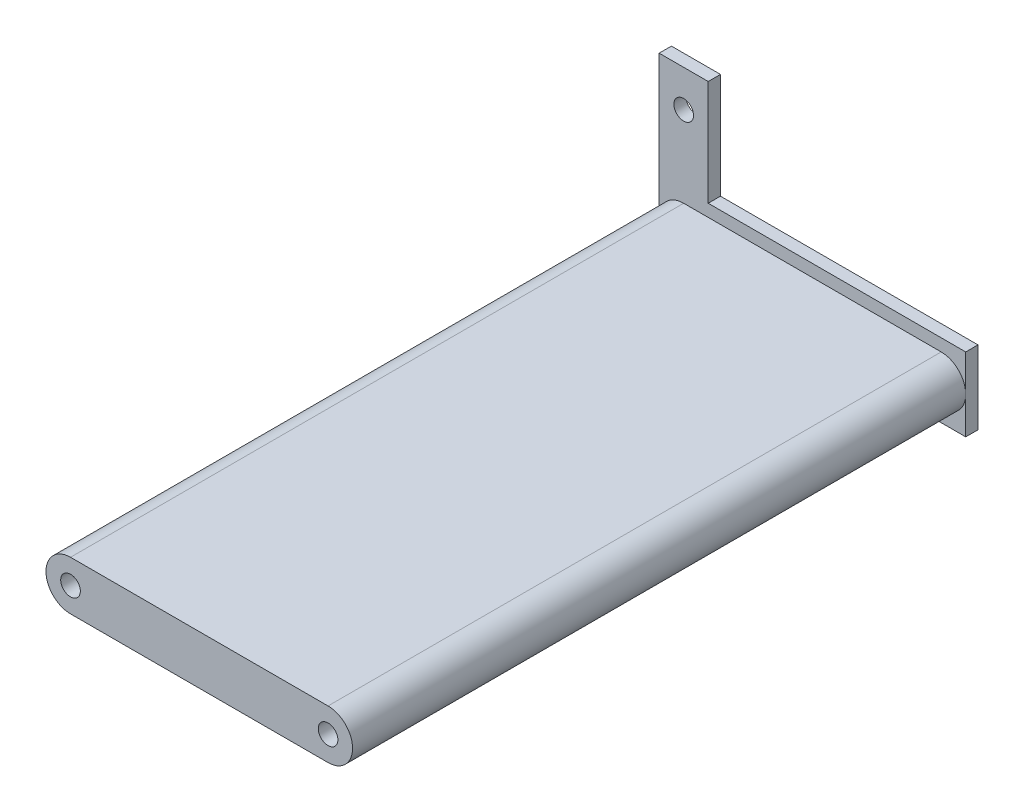
ISO-10303-21;
HEADER;
FILE_DESCRIPTION(('STEP AP214'),'2;1');
FILE_NAME('part.step','',(''),(''),'','','');
FILE_SCHEMA(('AUTOMOTIVE_DESIGN { 1 0 10303 214 1 1 1 1 }'));
ENDSEC;
DATA;
#1=APPLICATION_CONTEXT('core data for automotive mechanical design processes');
#2=APPLICATION_PROTOCOL_DEFINITION('international standard','automotive_design',2000,#1);
#3=PRODUCT_CONTEXT('',#1,'mechanical');
#4=PRODUCT('Part','Part','',(#3));
#5=PRODUCT_RELATED_PRODUCT_CATEGORY('part','',(#4));
#6=PRODUCT_DEFINITION_FORMATION('','',#4);
#7=PRODUCT_DEFINITION_CONTEXT('part definition',#1,'design');
#8=PRODUCT_DEFINITION('design','',#6,#7);
#9=PRODUCT_DEFINITION_SHAPE('','',#8);
#10=(LENGTH_UNIT() NAMED_UNIT(*) SI_UNIT(.MILLI.,.METRE.));
#11=(NAMED_UNIT(*) PLANE_ANGLE_UNIT() SI_UNIT($,.RADIAN.));
#12=(NAMED_UNIT(*) SI_UNIT($,.STERADIAN.) SOLID_ANGLE_UNIT());
#13=UNCERTAINTY_MEASURE_WITH_UNIT(LENGTH_MEASURE(1.E-05),#10,'distance_accuracy_value','');
#14=(GEOMETRIC_REPRESENTATION_CONTEXT(3) GLOBAL_UNCERTAINTY_ASSIGNED_CONTEXT((#13)) GLOBAL_UNIT_ASSIGNED_CONTEXT((#10,
#11,#12)) REPRESENTATION_CONTEXT('',''));
#15=CARTESIAN_POINT('',(0.,0.,0.));
#16=DIRECTION('',(0.,0.,1.));
#17=DIRECTION('',(1.,0.,0.));
#18=AXIS2_PLACEMENT_3D('',#15,#16,#17);
#19=CARTESIAN_POINT('',(0.,0.,1.27));
#20=DIRECTION('',(0.,0.,1.));
#21=DIRECTION('',(1.,0.,0.));
#22=AXIS2_PLACEMENT_3D('',#19,#20,#21);
#23=PLANE('',#22);
#24=DIRECTION('',(-1.,0.,0.));
#25=VECTOR('',#24,1.);
#26=CARTESIAN_POINT('',(-34.3291166187459,5.6003339009967,1.27));
#27=LINE('',#26,#25);
#28=CARTESIAN_POINT('',(-7.65911661874594,5.6003339009967,1.27));
#29=VERTEX_POINT('',#28);
#30=CARTESIAN_POINT('',(-34.3291166187459,5.6003339009967,1.27));
#31=VERTEX_POINT('',#30);
#32=EDGE_CURVE('E51',#29,#31,#27,.T.);
#33=ORIENTED_EDGE('',*,*,#32,.F.);
#34=CARTESIAN_POINT('',(-7.65911661874594,3.0603339009967,1.27));
#35=DIRECTION('',(0.,0.,1.));
#36=DIRECTION('',(1.,0.,0.));
#37=AXIS2_PLACEMENT_3D('',#34,#35,#36);
#38=CIRCLE('',#37,2.54);
#39=CARTESIAN_POINT('',(-5.11911661874593,3.0603339009967,1.27));
#40=VERTEX_POINT('',#39);
#41=EDGE_CURVE('E11',#40,#29,#38,.T.);
#42=ORIENTED_EDGE('',*,*,#41,.F.);
#43=DIRECTION('',(0.,1.,0.));
#44=VECTOR('',#43,1.);
#45=CARTESIAN_POINT('',(-5.11911661874593,-0.749666099003301,1.27));
#46=LINE('',#45,#44);
#47=CARTESIAN_POINT('',(-5.11911661874593,6.8703339009967,1.27));
#48=VERTEX_POINT('',#47);
#49=EDGE_CURVE('E168',#40,#48,#46,.T.);
#50=ORIENTED_EDGE('',*,*,#49,.T.);
#51=DIRECTION('',(-1.,0.,0.));
#52=VECTOR('',#51,1.);
#53=CARTESIAN_POINT('',(-5.11911661874593,6.8703339009967,1.27));
#54=LINE('',#53,#52);
#55=CARTESIAN_POINT('',(-31.7891166187459,6.87033390099669,1.27));
#56=VERTEX_POINT('',#55);
#57=EDGE_CURVE('E172',#48,#56,#54,.T.);
#58=ORIENTED_EDGE('',*,*,#57,.T.);
#59=DIRECTION('',(0.,1.,0.));
#60=VECTOR('',#59,1.);
#61=CARTESIAN_POINT('',(-31.7891166187459,6.87033390099669,1.27));
#62=LINE('',#61,#60);
#63=CARTESIAN_POINT('',(-31.7891166187459,17.7923339009967,1.27));
#64=VERTEX_POINT('',#63);
#65=EDGE_CURVE('E174',#56,#64,#62,.T.);
#66=ORIENTED_EDGE('',*,*,#65,.T.);
#67=DIRECTION('',(-1.,0.,0.));
#68=VECTOR('',#67,1.);
#69=CARTESIAN_POINT('',(-31.7891166187459,17.7923339009967,1.27));
#70=LINE('',#69,#68);
#71=CARTESIAN_POINT('',(-36.8691166187459,17.7923339009967,1.27));
#72=VERTEX_POINT('',#71);
#73=EDGE_CURVE('E159',#64,#72,#70,.T.);
#74=ORIENTED_EDGE('',*,*,#73,.T.);
#75=DIRECTION('',(0.,-1.,0.));
#76=VECTOR('',#75,1.);
#77=CARTESIAN_POINT('',(-36.8691166187459,17.7923339009967,1.27));
#78=LINE('',#77,#76);
#79=CARTESIAN_POINT('',(-36.8691166187459,3.0603339009967,1.27));
#80=VERTEX_POINT('',#79);
#81=EDGE_CURVE('E164',#72,#80,#78,.T.);
#82=ORIENTED_EDGE('',*,*,#81,.T.);
#83=CARTESIAN_POINT('',(-34.3291166187459,3.0603339009967,1.27));
#84=DIRECTION('',(0.,0.,1.));
#85=DIRECTION('',(1.,0.,0.));
#86=AXIS2_PLACEMENT_3D('',#83,#84,#85);
#87=CIRCLE('',#86,2.54);
#88=EDGE_CURVE('E55',#31,#80,#87,.T.);
#89=ORIENTED_EDGE('',*,*,#88,.F.);
#90=EDGE_LOOP('',(#33,#42,#50,#58,#66,#74,#82,#89));
#91=FACE_BOUND('',#90,.T.);
#92=CARTESIAN_POINT('',(-34.3291166187459,13.9823339009967,1.27));
#93=DIRECTION('',(0.,0.,1.));
#94=DIRECTION('',(1.,0.,0.));
#95=AXIS2_PLACEMENT_3D('',#92,#93,#94);
#96=CIRCLE('',#95,1.016);
#97=CARTESIAN_POINT('',(-33.3131166187459,13.9823339009967,1.27));
#98=VERTEX_POINT('',#97);
#99=EDGE_CURVE('E153',#98,#98,#96,.T.);
#100=ORIENTED_EDGE('',*,*,#99,.F.);
#101=EDGE_LOOP('',(#100));
#102=FACE_BOUND('',#101,.T.);
#103=ADVANCED_FACE('F33',(#91,#102),#23,.T.);
#104=CARTESIAN_POINT('',(-34.3291166187459,0.520333900996695,1.27));
#105=VERTEX_POINT('',#104);
#106=EDGE_CURVE('E42',#80,#105,#87,.T.);
#107=ORIENTED_EDGE('',*,*,#106,.F.);
#108=CARTESIAN_POINT('',(-36.8691166187459,-0.749666099003301,1.27));
#109=VERTEX_POINT('',#108);
#110=EDGE_CURVE('E162',#80,#109,#78,.T.);
#111=ORIENTED_EDGE('',*,*,#110,.T.);
#112=DIRECTION('',(1.,0.,0.));
#113=VECTOR('',#112,1.);
#114=CARTESIAN_POINT('',(-36.8691166187459,-0.749666099003301,1.27));
#115=LINE('',#114,#113);
#116=CARTESIAN_POINT('',(-5.11911661874593,-0.749666099003301,1.27));
#117=VERTEX_POINT('',#116);
#118=EDGE_CURVE('E166',#109,#117,#115,.T.);
#119=ORIENTED_EDGE('',*,*,#118,.T.);
#120=EDGE_CURVE('E169',#117,#40,#46,.T.);
#121=ORIENTED_EDGE('',*,*,#120,.T.);
#122=CARTESIAN_POINT('',(-7.65911661874594,0.520333900996695,1.27));
#123=VERTEX_POINT('',#122);
#124=EDGE_CURVE('E44',#123,#40,#38,.T.);
#125=ORIENTED_EDGE('',*,*,#124,.F.);
#126=DIRECTION('',(1.,0.,0.));
#127=VECTOR('',#126,1.);
#128=CARTESIAN_POINT('',(-34.3291166187459,0.520333900996695,1.27));
#129=LINE('',#128,#127);
#130=EDGE_CURVE('E210',#105,#123,#129,.T.);
#131=ORIENTED_EDGE('',*,*,#130,.F.);
#132=EDGE_LOOP('',(#107,#111,#119,#121,#125,#131));
#133=FACE_BOUND('',#132,.T.);
#134=ADVANCED_FACE('F229',(#133),#23,.T.);
#135=CARTESIAN_POINT('',(0.,0.,0.));
#136=DIRECTION('',(0.,0.,1.));
#137=DIRECTION('',(1.,0.,0.));
#138=AXIS2_PLACEMENT_3D('',#135,#136,#137);
#139=PLANE('',#138);
#140=DIRECTION('',(-1.,0.,0.));
#141=VECTOR('',#140,1.);
#142=CARTESIAN_POINT('',(-31.7891166187459,17.7923339009967,0.));
#143=LINE('',#142,#141);
#144=CARTESIAN_POINT('',(-31.7891166187459,17.7923339009967,0.));
#145=VERTEX_POINT('',#144);
#146=CARTESIAN_POINT('',(-36.8691166187459,17.7923339009967,0.));
#147=VERTEX_POINT('',#146);
#148=EDGE_CURVE('E156',#145,#147,#143,.T.);
#149=ORIENTED_EDGE('',*,*,#148,.F.);
#150=DIRECTION('',(0.,1.,0.));
#151=VECTOR('',#150,1.);
#152=CARTESIAN_POINT('',(-31.7891166187459,6.87033390099669,0.));
#153=LINE('',#152,#151);
#154=CARTESIAN_POINT('',(-31.7891166187459,6.87033390099669,0.));
#155=VERTEX_POINT('',#154);
#156=EDGE_CURVE('E163',#155,#145,#153,.T.);
#157=ORIENTED_EDGE('',*,*,#156,.F.);
#158=DIRECTION('',(-1.,0.,0.));
#159=VECTOR('',#158,1.);
#160=CARTESIAN_POINT('',(-5.11911661874593,6.8703339009967,0.));
#161=LINE('',#160,#159);
#162=CARTESIAN_POINT('',(-5.11911661874593,6.8703339009967,0.));
#163=VERTEX_POINT('',#162);
#164=EDGE_CURVE('E185',#163,#155,#161,.T.);
#165=ORIENTED_EDGE('',*,*,#164,.F.);
#166=DIRECTION('',(0.,1.,0.));
#167=VECTOR('',#166,1.);
#168=CARTESIAN_POINT('',(-5.11911661874593,-0.749666099003301,0.));
#169=LINE('',#168,#167);
#170=CARTESIAN_POINT('',(-5.11911661874593,-0.749666099003301,0.));
#171=VERTEX_POINT('',#170);
#172=EDGE_CURVE('E183',#171,#163,#169,.T.);
#173=ORIENTED_EDGE('',*,*,#172,.F.);
#174=DIRECTION('',(1.,0.,0.));
#175=VECTOR('',#174,1.);
#176=CARTESIAN_POINT('',(-36.8691166187459,-0.749666099003301,0.));
#177=LINE('',#176,#175);
#178=CARTESIAN_POINT('',(-36.8691166187459,-0.749666099003301,0.));
#179=VERTEX_POINT('',#178);
#180=EDGE_CURVE('E181',#179,#171,#177,.T.);
#181=ORIENTED_EDGE('',*,*,#180,.F.);
#182=DIRECTION('',(0.,-1.,0.));
#183=VECTOR('',#182,1.);
#184=CARTESIAN_POINT('',(-36.8691166187459,17.7923339009967,0.));
#185=LINE('',#184,#183);
#186=EDGE_CURVE('E179',#147,#179,#185,.T.);
#187=ORIENTED_EDGE('',*,*,#186,.F.);
#188=EDGE_LOOP('',(#149,#157,#165,#173,#181,#187));
#189=FACE_BOUND('',#188,.T.);
#190=CARTESIAN_POINT('',(-34.3291166187459,13.9823339009967,0.));
#191=DIRECTION('',(0.,0.,1.));
#192=DIRECTION('',(1.,0.,0.));
#193=AXIS2_PLACEMENT_3D('',#190,#191,#192);
#194=CIRCLE('',#193,1.016);
#195=CARTESIAN_POINT('',(-33.3131166187459,13.9823339009967,0.));
#196=VERTEX_POINT('',#195);
#197=EDGE_CURVE('E152',#196,#196,#194,.T.);
#198=ORIENTED_EDGE('',*,*,#197,.T.);
#199=EDGE_LOOP('',(#198));
#200=FACE_BOUND('',#199,.T.);
#201=CARTESIAN_POINT('',(-34.3291166187459,3.0603339009967,0.));
#202=DIRECTION('',(0.,0.,1.));
#203=DIRECTION('',(1.,0.,0.));
#204=AXIS2_PLACEMENT_3D('',#201,#202,#203);
#205=CIRCLE('',#204,1.016);
#206=CARTESIAN_POINT('',(-33.3131166187459,3.0603339009967,0.));
#207=VERTEX_POINT('',#206);
#208=EDGE_CURVE('E144',#207,#207,#205,.T.);
#209=ORIENTED_EDGE('',*,*,#208,.T.);
#210=EDGE_LOOP('',(#209));
#211=FACE_BOUND('',#210,.T.);
#212=CARTESIAN_POINT('',(-7.65911661874594,3.0603339009967,0.));
#213=DIRECTION('',(0.,0.,1.));
#214=DIRECTION('',(1.,0.,0.));
#215=AXIS2_PLACEMENT_3D('',#212,#213,#214);
#216=CIRCLE('',#215,1.016);
#217=CARTESIAN_POINT('',(-6.64311661874594,3.0603339009967,0.));
#218=VERTEX_POINT('',#217);
#219=EDGE_CURVE('E141',#218,#218,#216,.T.);
#220=ORIENTED_EDGE('',*,*,#219,.T.);
#221=EDGE_LOOP('',(#220));
#222=FACE_BOUND('',#221,.T.);
#223=ADVANCED_FACE('F255',(#189,#200,#211,#222),#139,.F.);
#224=CARTESIAN_POINT('',(-31.7891166187459,17.7923339009967,1.27));
#225=DIRECTION('',(0.,-1.,0.));
#226=DIRECTION('',(0.,0.,-1.));
#227=AXIS2_PLACEMENT_3D('',#224,#225,#226);
#228=PLANE('',#227);
#229=ORIENTED_EDGE('',*,*,#148,.T.);
#230=DIRECTION('',(0.,0.,-1.));
#231=VECTOR('',#230,1.);
#232=CARTESIAN_POINT('',(-36.8691166187459,17.7923339009967,1.27));
#233=LINE('',#232,#231);
#234=EDGE_CURVE('E37',#72,#147,#233,.T.);
#235=ORIENTED_EDGE('',*,*,#234,.F.);
#236=ORIENTED_EDGE('',*,*,#73,.F.);
#237=DIRECTION('',(0.,0.,-1.));
#238=VECTOR('',#237,1.);
#239=CARTESIAN_POINT('',(-31.7891166187459,17.7923339009967,1.27));
#240=LINE('',#239,#238);
#241=EDGE_CURVE('E176',#64,#145,#240,.T.);
#242=ORIENTED_EDGE('',*,*,#241,.T.);
#243=EDGE_LOOP('',(#229,#235,#236,#242));
#244=FACE_BOUND('',#243,.T.);
#245=ADVANCED_FACE('F35',(#244),#228,.F.);
#246=CARTESIAN_POINT('',(-36.8691166187459,17.7923339009967,1.27));
#247=DIRECTION('',(1.,0.,0.));
#248=DIRECTION('',(0.,0.,-1.));
#249=AXIS2_PLACEMENT_3D('',#246,#247,#248);
#250=PLANE('',#249);
#251=ORIENTED_EDGE('',*,*,#186,.T.);
#252=DIRECTION('',(0.,0.,-1.));
#253=VECTOR('',#252,1.);
#254=CARTESIAN_POINT('',(-36.8691166187459,-0.749666099003301,1.27));
#255=LINE('',#254,#253);
#256=EDGE_CURVE('E198',#109,#179,#255,.T.);
#257=ORIENTED_EDGE('',*,*,#256,.F.);
#258=ORIENTED_EDGE('',*,*,#110,.F.);
#259=ORIENTED_EDGE('',*,*,#81,.F.);
#260=ORIENTED_EDGE('',*,*,#234,.T.);
#261=EDGE_LOOP('',(#251,#257,#258,#259,#260));
#262=FACE_BOUND('',#261,.T.);
#263=ADVANCED_FACE('F252',(#262),#250,.F.);
#264=CARTESIAN_POINT('',(-36.8691166187459,-0.749666099003301,1.27));
#265=DIRECTION('',(0.,1.,0.));
#266=DIRECTION('',(0.,0.,1.));
#267=AXIS2_PLACEMENT_3D('',#264,#265,#266);
#268=PLANE('',#267);
#269=ORIENTED_EDGE('',*,*,#180,.T.);
#270=DIRECTION('',(0.,0.,-1.));
#271=VECTOR('',#270,1.);
#272=CARTESIAN_POINT('',(-5.11911661874593,-0.749666099003301,1.27));
#273=LINE('',#272,#271);
#274=EDGE_CURVE('E196',#117,#171,#273,.T.);
#275=ORIENTED_EDGE('',*,*,#274,.F.);
#276=ORIENTED_EDGE('',*,*,#118,.F.);
#277=ORIENTED_EDGE('',*,*,#256,.T.);
#278=EDGE_LOOP('',(#269,#275,#276,#277));
#279=FACE_BOUND('',#278,.T.);
#280=ADVANCED_FACE('F253',(#279),#268,.F.);
#281=CARTESIAN_POINT('',(-5.11911661874593,-0.749666099003301,1.27));
#282=DIRECTION('',(-1.,0.,0.));
#283=DIRECTION('',(0.,0.,1.));
#284=AXIS2_PLACEMENT_3D('',#281,#282,#283);
#285=PLANE('',#284);
#286=ORIENTED_EDGE('',*,*,#172,.T.);
#287=DIRECTION('',(0.,0.,-1.));
#288=VECTOR('',#287,1.);
#289=CARTESIAN_POINT('',(-5.11911661874593,6.8703339009967,1.27));
#290=LINE('',#289,#288);
#291=EDGE_CURVE('E193',#48,#163,#290,.T.);
#292=ORIENTED_EDGE('',*,*,#291,.F.);
#293=ORIENTED_EDGE('',*,*,#49,.F.);
#294=ORIENTED_EDGE('',*,*,#120,.F.);
#295=ORIENTED_EDGE('',*,*,#274,.T.);
#296=EDGE_LOOP('',(#286,#292,#293,#294,#295));
#297=FACE_BOUND('',#296,.T.);
#298=ADVANCED_FACE('F234',(#297),#285,.F.);
#299=CARTESIAN_POINT('',(-5.11911661874593,6.8703339009967,1.27));
#300=DIRECTION('',(0.,-1.,0.));
#301=DIRECTION('',(1.,0.,0.));
#302=AXIS2_PLACEMENT_3D('',#299,#300,#301);
#303=PLANE('',#302);
#304=ORIENTED_EDGE('',*,*,#164,.T.);
#305=DIRECTION('',(0.,0.,-1.));
#306=VECTOR('',#305,1.);
#307=CARTESIAN_POINT('',(-31.7891166187459,6.87033390099669,1.27));
#308=LINE('',#307,#306);
#309=EDGE_CURVE('E190',#56,#155,#308,.T.);
#310=ORIENTED_EDGE('',*,*,#309,.F.);
#311=ORIENTED_EDGE('',*,*,#57,.F.);
#312=ORIENTED_EDGE('',*,*,#291,.T.);
#313=EDGE_LOOP('',(#304,#310,#311,#312));
#314=FACE_BOUND('',#313,.T.);
#315=ADVANCED_FACE('F243',(#314),#303,.F.);
#316=CARTESIAN_POINT('',(-31.7891166187459,6.87033390099669,1.27));
#317=DIRECTION('',(-1.,0.,0.));
#318=DIRECTION('',(0.,0.,1.));
#319=AXIS2_PLACEMENT_3D('',#316,#317,#318);
#320=PLANE('',#319);
#321=ORIENTED_EDGE('',*,*,#156,.T.);
#322=ORIENTED_EDGE('',*,*,#241,.F.);
#323=ORIENTED_EDGE('',*,*,#65,.F.);
#324=ORIENTED_EDGE('',*,*,#309,.T.);
#325=EDGE_LOOP('',(#321,#322,#323,#324));
#326=FACE_BOUND('',#325,.T.);
#327=ADVANCED_FACE('F247',(#326),#320,.F.);
#328=CARTESIAN_POINT('',(-34.3291166187459,13.9823339009967,1.27));
#329=DIRECTION('',(0.,0.,-1.));
#330=DIRECTION('',(-1.,0.,0.));
#331=AXIS2_PLACEMENT_3D('',#328,#329,#330);
#332=CYLINDRICAL_SURFACE('',#331,1.016);
#333=ORIENTED_EDGE('',*,*,#99,.T.);
#334=EDGE_LOOP('',(#333));
#335=FACE_BOUND('',#334,.T.);
#336=ORIENTED_EDGE('',*,*,#197,.F.);
#337=EDGE_LOOP('',(#336));
#338=FACE_BOUND('',#337,.T.);
#339=ADVANCED_FACE('F285',(#335,#338),#332,.F.);
#340=CARTESIAN_POINT('',(-34.3291166187459,3.0603339009967,1.27));
#341=DIRECTION('',(0.,0.,-1.));
#342=DIRECTION('',(-1.,0.,0.));
#343=AXIS2_PLACEMENT_3D('',#340,#341,#342);
#344=CYLINDRICAL_SURFACE('',#343,1.016);
#345=ORIENTED_EDGE('',*,*,#208,.F.);
#346=EDGE_LOOP('',(#345));
#347=FACE_BOUND('',#346,.T.);
#348=CARTESIAN_POINT('',(-34.3291166187459,3.0603339009967,64.77));
#349=DIRECTION('',(0.,0.,1.));
#350=DIRECTION('',(1.,0.,0.));
#351=AXIS2_PLACEMENT_3D('',#348,#349,#350);
#352=CIRCLE('',#351,1.016);
#353=CARTESIAN_POINT('',(-33.3131166187459,3.0603339009967,64.77));
#354=VERTEX_POINT('',#353);
#355=EDGE_CURVE('E211',#354,#354,#352,.T.);
#356=ORIENTED_EDGE('',*,*,#355,.T.);
#357=EDGE_LOOP('',(#356));
#358=FACE_BOUND('',#357,.T.);
#359=ADVANCED_FACE('F268',(#347,#358),#344,.F.);
#360=CARTESIAN_POINT('',(-7.65911661874594,3.0603339009967,1.27));
#361=DIRECTION('',(0.,0.,-1.));
#362=DIRECTION('',(-1.,0.,0.));
#363=AXIS2_PLACEMENT_3D('',#360,#361,#362);
#364=CYLINDRICAL_SURFACE('',#363,1.016);
#365=ORIENTED_EDGE('',*,*,#219,.F.);
#366=EDGE_LOOP('',(#365));
#367=FACE_BOUND('',#366,.T.);
#368=CARTESIAN_POINT('',(-7.65911661874594,3.0603339009967,64.77));
#369=DIRECTION('',(0.,0.,1.));
#370=DIRECTION('',(1.,0.,0.));
#371=AXIS2_PLACEMENT_3D('',#368,#369,#370);
#372=CIRCLE('',#371,1.016);
#373=CARTESIAN_POINT('',(-6.64311661874594,3.0603339009967,64.77));
#374=VERTEX_POINT('',#373);
#375=EDGE_CURVE('E213',#374,#374,#372,.T.);
#376=ORIENTED_EDGE('',*,*,#375,.T.);
#377=EDGE_LOOP('',(#376));
#378=FACE_BOUND('',#377,.T.);
#379=ADVANCED_FACE('F265',(#367,#378),#364,.F.);
#380=CARTESIAN_POINT('',(-34.3291166187459,3.0603339009967,64.77));
#381=DIRECTION('',(0.,0.,1.));
#382=DIRECTION('',(1.,0.,0.));
#383=AXIS2_PLACEMENT_3D('',#380,#381,#382);
#384=PLANE('',#383);
#385=ORIENTED_EDGE('',*,*,#355,.F.);
#386=EDGE_LOOP('',(#385));
#387=FACE_BOUND('',#386,.T.);
#388=CARTESIAN_POINT('',(-34.3291166187459,3.0603339009967,64.77));
#389=DIRECTION('',(0.,0.,1.));
#390=DIRECTION('',(1.,0.,0.));
#391=AXIS2_PLACEMENT_3D('',#388,#389,#390);
#392=CIRCLE('',#391,2.54);
#393=CARTESIAN_POINT('',(-34.3291166187459,5.6003339009967,64.77));
#394=VERTEX_POINT('',#393);
#395=CARTESIAN_POINT('',(-34.3291166187459,0.520333900996695,64.77));
#396=VERTEX_POINT('',#395);
#397=EDGE_CURVE('E128',#394,#396,#392,.T.);
#398=ORIENTED_EDGE('',*,*,#397,.T.);
#399=DIRECTION('',(1.,0.,0.));
#400=VECTOR('',#399,1.);
#401=CARTESIAN_POINT('',(-34.3291166187459,0.520333900996695,64.77));
#402=LINE('',#401,#400);
#403=CARTESIAN_POINT('',(-7.65911661874594,0.520333900996695,64.77));
#404=VERTEX_POINT('',#403);
#405=EDGE_CURVE('E117',#396,#404,#402,.T.);
#406=ORIENTED_EDGE('',*,*,#405,.T.);
#407=CARTESIAN_POINT('',(-7.65911661874594,3.0603339009967,64.77));
#408=DIRECTION('',(0.,0.,1.));
#409=DIRECTION('',(1.,0.,0.));
#410=AXIS2_PLACEMENT_3D('',#407,#408,#409);
#411=CIRCLE('',#410,2.54);
#412=CARTESIAN_POINT('',(-7.65911661874594,5.6003339009967,64.77));
#413=VERTEX_POINT('',#412);
#414=EDGE_CURVE('E127',#404,#413,#411,.T.);
#415=ORIENTED_EDGE('',*,*,#414,.T.);
#416=DIRECTION('',(-1.,0.,0.));
#417=VECTOR('',#416,1.);
#418=CARTESIAN_POINT('',(-34.3291166187459,5.6003339009967,64.77));
#419=LINE('',#418,#417);
#420=EDGE_CURVE('E134',#413,#394,#419,.T.);
#421=ORIENTED_EDGE('',*,*,#420,.T.);
#422=EDGE_LOOP('',(#398,#406,#415,#421));
#423=FACE_BOUND('',#422,.T.);
#424=ORIENTED_EDGE('',*,*,#375,.F.);
#425=EDGE_LOOP('',(#424));
#426=FACE_BOUND('',#425,.T.);
#427=ADVANCED_FACE('F131',(#387,#423,#426),#384,.T.);
#428=CARTESIAN_POINT('',(-34.3291166187459,3.0603339009967,64.77));
#429=DIRECTION('',(0.,0.,-1.));
#430=DIRECTION('',(-1.,0.,0.));
#431=AXIS2_PLACEMENT_3D('',#428,#429,#430);
#432=CYLINDRICAL_SURFACE('',#431,2.54);
#433=ORIENTED_EDGE('',*,*,#88,.T.);
#434=ORIENTED_EDGE('',*,*,#106,.T.);
#435=DIRECTION('',(0.,0.,-1.));
#436=VECTOR('',#435,1.);
#437=CARTESIAN_POINT('',(-34.3291166187459,0.520333900996695,64.77));
#438=LINE('',#437,#436);
#439=EDGE_CURVE('E122',#396,#105,#438,.T.);
#440=ORIENTED_EDGE('',*,*,#439,.F.);
#441=ORIENTED_EDGE('',*,*,#397,.F.);
#442=DIRECTION('',(0.,0.,-1.));
#443=VECTOR('',#442,1.);
#444=CARTESIAN_POINT('',(-34.3291166187459,5.6003339009967,64.77));
#445=LINE('',#444,#443);
#446=EDGE_CURVE('E220',#394,#31,#445,.T.);
#447=ORIENTED_EDGE('',*,*,#446,.T.);
#448=EDGE_LOOP('',(#433,#434,#440,#441,#447));
#449=FACE_BOUND('',#448,.T.);
#450=ADVANCED_FACE('F140',(#449),#432,.T.);
#451=CARTESIAN_POINT('',(-34.3291166187459,0.520333900996695,64.77));
#452=DIRECTION('',(0.,1.,0.));
#453=DIRECTION('',(-1.,0.,0.));
#454=AXIS2_PLACEMENT_3D('',#451,#452,#453);
#455=PLANE('',#454);
#456=ORIENTED_EDGE('',*,*,#130,.T.);
#457=DIRECTION('',(0.,0.,-1.));
#458=VECTOR('',#457,1.);
#459=CARTESIAN_POINT('',(-7.65911661874594,0.520333900996695,64.77));
#460=LINE('',#459,#458);
#461=EDGE_CURVE('E124',#404,#123,#460,.T.);
#462=ORIENTED_EDGE('',*,*,#461,.F.);
#463=ORIENTED_EDGE('',*,*,#405,.F.);
#464=ORIENTED_EDGE('',*,*,#439,.T.);
#465=EDGE_LOOP('',(#456,#462,#463,#464));
#466=FACE_BOUND('',#465,.T.);
#467=ADVANCED_FACE('F120',(#466),#455,.F.);
#468=CARTESIAN_POINT('',(-7.65911661874594,3.0603339009967,64.77));
#469=DIRECTION('',(0.,0.,-1.));
#470=DIRECTION('',(-1.,0.,0.));
#471=AXIS2_PLACEMENT_3D('',#468,#469,#470);
#472=CYLINDRICAL_SURFACE('',#471,2.54);
#473=ORIENTED_EDGE('',*,*,#124,.T.);
#474=ORIENTED_EDGE('',*,*,#41,.T.);
#475=DIRECTION('',(0.,0.,-1.));
#476=VECTOR('',#475,1.);
#477=CARTESIAN_POINT('',(-7.65911661874594,5.6003339009967,64.77));
#478=LINE('',#477,#476);
#479=EDGE_CURVE('E146',#413,#29,#478,.T.);
#480=ORIENTED_EDGE('',*,*,#479,.F.);
#481=ORIENTED_EDGE('',*,*,#414,.F.);
#482=ORIENTED_EDGE('',*,*,#461,.T.);
#483=EDGE_LOOP('',(#473,#474,#480,#481,#482));
#484=FACE_BOUND('',#483,.T.);
#485=ADVANCED_FACE('F226',(#484),#472,.T.);
#486=CARTESIAN_POINT('',(-34.3291166187459,5.6003339009967,64.77));
#487=DIRECTION('',(0.,-1.,0.));
#488=DIRECTION('',(1.,0.,0.));
#489=AXIS2_PLACEMENT_3D('',#486,#487,#488);
#490=PLANE('',#489);
#491=ORIENTED_EDGE('',*,*,#32,.T.);
#492=ORIENTED_EDGE('',*,*,#446,.F.);
#493=ORIENTED_EDGE('',*,*,#420,.F.);
#494=ORIENTED_EDGE('',*,*,#479,.T.);
#495=EDGE_LOOP('',(#491,#492,#493,#494));
#496=FACE_BOUND('',#495,.T.);
#497=ADVANCED_FACE('F370',(#496),#490,.F.);
#498=CLOSED_SHELL('',(#103,#134,#223,#245,#263,#280,#298,#315,#327,#339,#359,#379,#427,#450,
#467,#485,#497));
#499=MANIFOLD_SOLID_BREP('B2',#498);
#500=ADVANCED_BREP_SHAPE_REPRESENTATION('',(#18,#499),#14);
#501=SHAPE_DEFINITION_REPRESENTATION(#9,#500);
ENDSEC;
END-ISO-10303-21;
